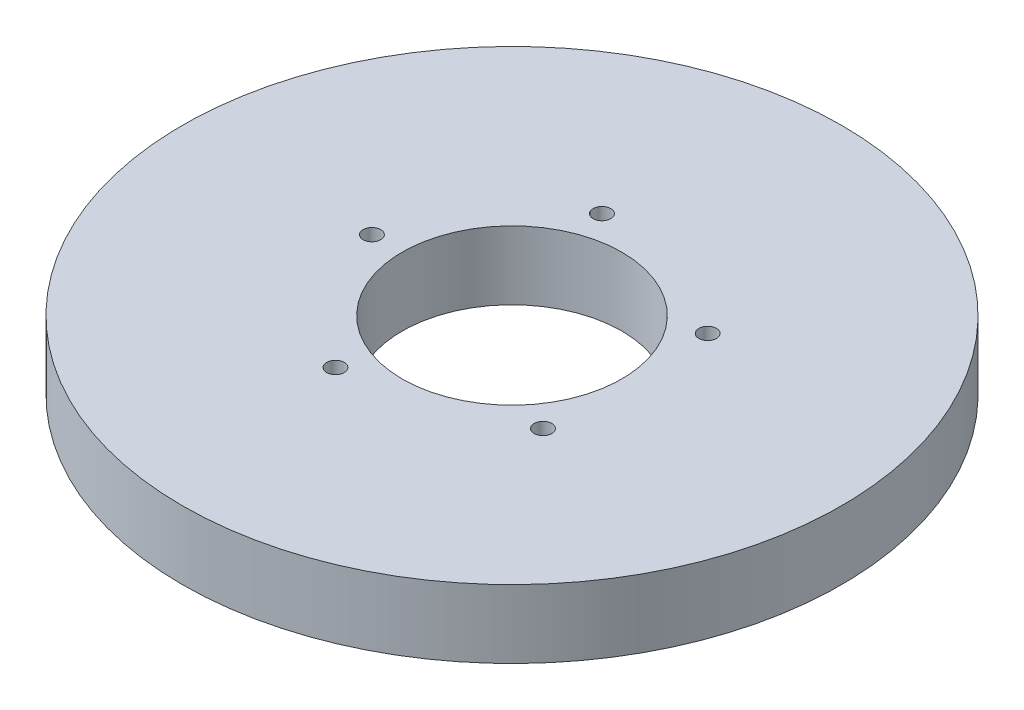
ISO-10303-21;
HEADER;
FILE_DESCRIPTION(('STEP AP214'),'2;1');
FILE_NAME('part.step','',(''),(''),'','','');
FILE_SCHEMA(('AUTOMOTIVE_DESIGN { 1 0 10303 214 1 1 1 1 }'));
ENDSEC;
DATA;
#1=APPLICATION_CONTEXT('core data for automotive mechanical design processes');
#2=APPLICATION_PROTOCOL_DEFINITION('international standard','automotive_design',2000,#1);
#3=PRODUCT_CONTEXT('',#1,'mechanical');
#4=PRODUCT('Part','Part','',(#3));
#5=PRODUCT_RELATED_PRODUCT_CATEGORY('part','',(#4));
#6=PRODUCT_DEFINITION_FORMATION('','',#4);
#7=PRODUCT_DEFINITION_CONTEXT('part definition',#1,'design');
#8=PRODUCT_DEFINITION('design','',#6,#7);
#9=PRODUCT_DEFINITION_SHAPE('','',#8);
#10=(LENGTH_UNIT() NAMED_UNIT(*) SI_UNIT(.MILLI.,.METRE.));
#11=(NAMED_UNIT(*) PLANE_ANGLE_UNIT() SI_UNIT($,.RADIAN.));
#12=(NAMED_UNIT(*) SI_UNIT($,.STERADIAN.) SOLID_ANGLE_UNIT());
#13=UNCERTAINTY_MEASURE_WITH_UNIT(LENGTH_MEASURE(1.E-05),#10,'distance_accuracy_value','');
#14=(GEOMETRIC_REPRESENTATION_CONTEXT(3) GLOBAL_UNCERTAINTY_ASSIGNED_CONTEXT((#13)) GLOBAL_UNIT_ASSIGNED_CONTEXT((#10,
#11,#12)) REPRESENTATION_CONTEXT('',''));
#15=CARTESIAN_POINT('',(0.,0.,0.));
#16=DIRECTION('',(0.,0.,1.));
#17=DIRECTION('',(1.,0.,0.));
#18=AXIS2_PLACEMENT_3D('',#15,#16,#17);
#19=CARTESIAN_POINT('',(0.,14.,0.));
#20=DIRECTION('',(0.,-1.,0.));
#21=DIRECTION('',(0.,0.,-1.));
#22=AXIS2_PLACEMENT_3D('',#19,#20,#21);
#23=CYLINDRICAL_SURFACE('',#22,67.5);
#24=CARTESIAN_POINT('',(0.,14.,0.));
#25=DIRECTION('',(0.,1.,0.));
#26=DIRECTION('',(0.,0.,1.));
#27=AXIS2_PLACEMENT_3D('',#24,#25,#26);
#28=CIRCLE('',#27,67.5);
#29=CARTESIAN_POINT('',(0.,14.,67.5));
#30=VERTEX_POINT('',#29);
#31=EDGE_CURVE('E10',#30,#30,#28,.T.);
#32=ORIENTED_EDGE('',*,*,#31,.F.);
#33=EDGE_LOOP('',(#32));
#34=FACE_BOUND('',#33,.T.);
#35=CARTESIAN_POINT('',(0.,0.,0.));
#36=DIRECTION('',(0.,1.,0.));
#37=DIRECTION('',(0.,0.,1.));
#38=AXIS2_PLACEMENT_3D('',#35,#36,#37);
#39=CIRCLE('',#38,67.5);
#40=CARTESIAN_POINT('',(0.,0.,67.5));
#41=VERTEX_POINT('',#40);
#42=EDGE_CURVE('E37',#41,#41,#39,.T.);
#43=ORIENTED_EDGE('',*,*,#42,.T.);
#44=EDGE_LOOP('',(#43));
#45=FACE_BOUND('',#44,.T.);
#46=ADVANCED_FACE('F40',(#34,#45),#23,.T.);
#47=CARTESIAN_POINT('',(0.,14.,0.));
#48=DIRECTION('',(0.,1.,0.));
#49=DIRECTION('',(0.,0.,1.));
#50=AXIS2_PLACEMENT_3D('',#47,#48,#49);
#51=PLANE('',#50);
#52=CARTESIAN_POINT('',(-8.86650054279167,14.,27.2882827529056));
#53=DIRECTION('',(0.,1.,0.));
#54=DIRECTION('',(0.951056516295155,0.,0.309016994374945));
#55=AXIS2_PLACEMENT_3D('',#52,#53,#54);
#56=CIRCLE('',#55,1.80070354562786);
#57=CARTESIAN_POINT('',(-8.86650054279167,14.,29.0889862985335));
#58=VERTEX_POINT('',#57);
#59=EDGE_CURVE('E78',#58,#58,#56,.T.);
#60=ORIENTED_EDGE('',*,*,#59,.F.);
#61=EDGE_LOOP('',(#60));
#62=FACE_BOUND('',#61,.T.);
#63=CARTESIAN_POINT('',(23.2127997822983,14.,16.8650862359131));
#64=DIRECTION('',(0.,1.,0.));
#65=DIRECTION('',(0.587785252292469,0.,-0.809016994374951));
#66=AXIS2_PLACEMENT_3D('',#63,#64,#65);
#67=CIRCLE('',#66,1.80070354562786);
#68=CARTESIAN_POINT('',(23.2127997822983,14.,18.6657897815409));
#69=VERTEX_POINT('',#68);
#70=EDGE_CURVE('E71',#69,#69,#67,.T.);
#71=ORIENTED_EDGE('',*,*,#70,.F.);
#72=EDGE_LOOP('',(#71));
#73=FACE_BOUND('',#72,.T.);
#74=CARTESIAN_POINT('',(23.212799782298,14.,-16.8650862359134));
#75=DIRECTION('',(0.,1.,0.));
#76=DIRECTION('',(-0.58778525229248,0.,-0.809016994374942));
#77=AXIS2_PLACEMENT_3D('',#74,#75,#76);
#78=CIRCLE('',#77,1.80070354562786);
#79=CARTESIAN_POINT('',(23.212799782298,14.,-15.0643826902856));
#80=VERTEX_POINT('',#79);
#81=EDGE_CURVE('E70',#80,#80,#78,.T.);
#82=ORIENTED_EDGE('',*,*,#81,.F.);
#83=EDGE_LOOP('',(#82));
#84=FACE_BOUND('',#83,.T.);
#85=CARTESIAN_POINT('',(-8.86650054279206,14.,-27.2882827529055));
#86=DIRECTION('',(0.,1.,0.));
#87=DIRECTION('',(-0.95105651629515,0.,0.309016994374958));
#88=AXIS2_PLACEMENT_3D('',#85,#86,#87);
#89=CIRCLE('',#88,1.80070354562786);
#90=CARTESIAN_POINT('',(-8.86650054279206,14.,-25.4875792072776));
#91=VERTEX_POINT('',#90);
#92=EDGE_CURVE('E61',#91,#91,#89,.T.);
#93=ORIENTED_EDGE('',*,*,#92,.F.);
#94=EDGE_LOOP('',(#93));
#95=FACE_BOUND('',#94,.T.);
#96=CARTESIAN_POINT('',(-28.6925984790129,14.,0.));
#97=DIRECTION('',(0.,1.,0.));
#98=DIRECTION('',(0.,0.,1.));
#99=AXIS2_PLACEMENT_3D('',#96,#97,#98);
#100=CIRCLE('',#99,1.80070354562786);
#101=CARTESIAN_POINT('',(-28.6925984790129,14.,1.80070354562786));
#102=VERTEX_POINT('',#101);
#103=EDGE_CURVE('E54',#102,#102,#100,.T.);
#104=ORIENTED_EDGE('',*,*,#103,.F.);
#105=EDGE_LOOP('',(#104));
#106=FACE_BOUND('',#105,.T.);
#107=CARTESIAN_POINT('',(0.,14.,0.));
#108=DIRECTION('',(0.,1.,0.));
#109=DIRECTION('',(0.,0.,1.));
#110=AXIS2_PLACEMENT_3D('',#107,#108,#109);
#111=CIRCLE('',#110,22.5);
#112=CARTESIAN_POINT('',(0.,14.,22.5));
#113=VERTEX_POINT('',#112);
#114=EDGE_CURVE('E50',#113,#113,#111,.T.);
#115=ORIENTED_EDGE('',*,*,#114,.F.);
#116=EDGE_LOOP('',(#115));
#117=FACE_BOUND('',#116,.T.);
#118=ORIENTED_EDGE('',*,*,#31,.T.);
#119=EDGE_LOOP('',(#118));
#120=FACE_BOUND('',#119,.T.);
#121=ADVANCED_FACE('F94',(#62,#73,#84,#95,#106,#117,#120),#51,.T.);
#122=CARTESIAN_POINT('',(0.,0.,0.));
#123=DIRECTION('',(0.,1.,0.));
#124=DIRECTION('',(0.,0.,1.));
#125=AXIS2_PLACEMENT_3D('',#122,#123,#124);
#126=PLANE('',#125);
#127=CARTESIAN_POINT('',(0.,0.,0.));
#128=DIRECTION('',(0.,1.,0.));
#129=DIRECTION('',(0.,0.,1.));
#130=AXIS2_PLACEMENT_3D('',#127,#128,#129);
#131=CIRCLE('',#130,22.5);
#132=CARTESIAN_POINT('',(0.,0.,22.5));
#133=VERTEX_POINT('',#132);
#134=EDGE_CURVE('E47',#133,#133,#131,.T.);
#135=ORIENTED_EDGE('',*,*,#134,.T.);
#136=EDGE_LOOP('',(#135));
#137=FACE_BOUND('',#136,.T.);
#138=ORIENTED_EDGE('',*,*,#42,.F.);
#139=EDGE_LOOP('',(#138));
#140=FACE_BOUND('',#139,.T.);
#141=ADVANCED_FACE('F100',(#137,#140),#126,.F.);
#142=CARTESIAN_POINT('',(0.,14.,0.));
#143=DIRECTION('',(0.,-1.,0.));
#144=DIRECTION('',(0.,0.,-1.));
#145=AXIS2_PLACEMENT_3D('',#142,#143,#144);
#146=CYLINDRICAL_SURFACE('',#145,22.5);
#147=ORIENTED_EDGE('',*,*,#114,.T.);
#148=EDGE_LOOP('',(#147));
#149=FACE_BOUND('',#148,.T.);
#150=ORIENTED_EDGE('',*,*,#134,.F.);
#151=EDGE_LOOP('',(#150));
#152=FACE_BOUND('',#151,.T.);
#153=ADVANCED_FACE('F108',(#149,#152),#146,.F.);
#154=CARTESIAN_POINT('',(-28.6925984790129,1.40341626221892,0.));
#155=DIRECTION('',(0.,1.,0.));
#156=DIRECTION('',(0.,0.,1.));
#157=AXIS2_PLACEMENT_3D('',#154,#155,#156);
#158=CYLINDRICAL_SURFACE('',#157,1.80070354562786);
#159=CARTESIAN_POINT('',(-28.6925984790129,1.40341626221892,0.));
#160=DIRECTION('',(0.,1.,0.));
#161=DIRECTION('',(0.,0.,1.));
#162=AXIS2_PLACEMENT_3D('',#159,#160,#161);
#163=CIRCLE('',#162,1.80070354562786);
#164=CARTESIAN_POINT('',(-28.6925984790129,1.40341626221892,1.80070354562786));
#165=VERTEX_POINT('',#164);
#166=EDGE_CURVE('E55',#165,#165,#163,.T.);
#167=CARTESIAN_POINT('',(-28.6925984790129,1.40341626221892,1.80070354562786));
#168=CARTESIAN_POINT('',(-28.6925984790129,1.53463067615414,1.80070354562786));
#169=CARTESIAN_POINT('',(-28.6925984790129,1.66584509008936,1.80070354562786));
#170=CARTESIAN_POINT('',(-28.6925984790129,1.92827391795979,1.80070354562786));
#171=CARTESIAN_POINT('',(-28.6925984790129,2.05948833189501,1.80070354562786));
#172=CARTESIAN_POINT('',(-28.6925984790129,2.32191715976545,1.80070354562786));
#173=CARTESIAN_POINT('',(-28.6925984790129,2.45313157370067,1.80070354562786));
#174=CARTESIAN_POINT('',(-28.6925984790129,2.71556040157111,1.80070354562786));
#175=CARTESIAN_POINT('',(-28.6925984790129,2.84677481550633,1.80070354562786));
#176=CARTESIAN_POINT('',(-28.6925984790129,3.10920364337677,1.80070354562786));
#177=CARTESIAN_POINT('',(-28.6925984790129,3.24041805731199,1.80070354562786));
#178=CARTESIAN_POINT('',(-28.6925984790129,3.50284688518243,1.80070354562786));
#179=CARTESIAN_POINT('',(-28.6925984790129,3.63406129911765,1.80070354562786));
#180=CARTESIAN_POINT('',(-28.6925984790129,3.89649012698809,1.80070354562786));
#181=CARTESIAN_POINT('',(-28.6925984790129,4.02770454092331,1.80070354562786));
#182=CARTESIAN_POINT('',(-28.6925984790129,4.29013336879375,1.80070354562786));
#183=CARTESIAN_POINT('',(-28.6925984790129,4.42134778272897,1.80070354562786));
#184=CARTESIAN_POINT('',(-28.6925984790129,4.68377661059941,1.80070354562786));
#185=CARTESIAN_POINT('',(-28.6925984790129,4.81499102453463,1.80070354562786));
#186=CARTESIAN_POINT('',(-28.6925984790129,5.07741985240507,1.80070354562786));
#187=CARTESIAN_POINT('',(-28.6925984790129,5.20863426634028,1.80070354562786));
#188=CARTESIAN_POINT('',(-28.6925984790129,5.47106309421072,1.80070354562786));
#189=CARTESIAN_POINT('',(-28.6925984790129,5.60227750814594,1.80070354562786));
#190=CARTESIAN_POINT('',(-28.6925984790129,5.86470633601638,1.80070354562786));
#191=CARTESIAN_POINT('',(-28.6925984790129,5.9959207499516,1.80070354562786));
#192=CARTESIAN_POINT('',(-28.6925984790129,6.25834957782204,1.80070354562786));
#193=CARTESIAN_POINT('',(-28.6925984790129,6.38956399175726,1.80070354562786));
#194=CARTESIAN_POINT('',(-28.6925984790129,6.6519928196277,1.80070354562786));
#195=CARTESIAN_POINT('',(-28.6925984790129,6.78320723356292,1.80070354562786));
#196=CARTESIAN_POINT('',(-28.6925984790129,7.04563606143336,1.80070354562786));
#197=CARTESIAN_POINT('',(-28.6925984790129,7.17685047536858,1.80070354562786));
#198=CARTESIAN_POINT('',(-28.6925984790129,7.43927930323902,1.80070354562786));
#199=CARTESIAN_POINT('',(-28.6925984790129,7.57049371717424,1.80070354562786));
#200=CARTESIAN_POINT('',(-28.6925984790129,7.83292254504468,1.80070354562786));
#201=CARTESIAN_POINT('',(-28.6925984790129,7.9641369589799,1.80070354562786));
#202=CARTESIAN_POINT('',(-28.6925984790129,8.22656578685034,1.80070354562786));
#203=CARTESIAN_POINT('',(-28.6925984790129,8.35778020078556,1.80070354562786));
#204=CARTESIAN_POINT('',(-28.6925984790129,8.62020902865599,1.80070354562786));
#205=CARTESIAN_POINT('',(-28.6925984790129,8.75142344259121,1.80070354562786));
#206=CARTESIAN_POINT('',(-28.6925984790129,9.01385227046165,1.80070354562786));
#207=CARTESIAN_POINT('',(-28.6925984790129,9.14506668439687,1.80070354562786));
#208=CARTESIAN_POINT('',(-28.6925984790129,9.40749551226731,1.80070354562786));
#209=CARTESIAN_POINT('',(-28.6925984790129,9.53870992620253,1.80070354562786));
#210=CARTESIAN_POINT('',(-28.6925984790129,9.80113875407297,1.80070354562786));
#211=CARTESIAN_POINT('',(-28.6925984790129,9.93235316800819,1.80070354562786));
#212=CARTESIAN_POINT('',(-28.6925984790129,10.1947819958786,1.80070354562786));
#213=CARTESIAN_POINT('',(-28.6925984790129,10.3259964098138,1.80070354562786));
#214=CARTESIAN_POINT('',(-28.6925984790129,10.5884252376843,1.80070354562786));
#215=CARTESIAN_POINT('',(-28.6925984790129,10.7196396516195,1.80070354562786));
#216=CARTESIAN_POINT('',(-28.6925984790129,10.9820684794899,1.80070354562786));
#217=CARTESIAN_POINT('',(-28.6925984790129,11.1132828934252,1.80070354562786));
#218=CARTESIAN_POINT('',(-28.6925984790129,11.3757117212956,1.80070354562786));
#219=CARTESIAN_POINT('',(-28.6925984790129,11.5069261352308,1.80070354562786));
#220=CARTESIAN_POINT('',(-28.6925984790129,11.7693549631013,1.80070354562786));
#221=CARTESIAN_POINT('',(-28.6925984790129,11.9005693770365,1.80070354562786));
#222=CARTESIAN_POINT('',(-28.6925984790129,12.1629982049069,1.80070354562786));
#223=CARTESIAN_POINT('',(-28.6925984790129,12.2942126188421,1.80070354562786));
#224=CARTESIAN_POINT('',(-28.6925984790129,12.5566414467126,1.80070354562786));
#225=CARTESIAN_POINT('',(-28.6925984790129,12.6878558606478,1.80070354562786));
#226=CARTESIAN_POINT('',(-28.6925984790129,12.9502846885182,1.80070354562786));
#227=CARTESIAN_POINT('',(-28.6925984790129,13.0814991024535,1.80070354562786));
#228=CARTESIAN_POINT('',(-28.6925984790129,13.3439279303239,1.80070354562786));
#229=CARTESIAN_POINT('',(-28.6925984790129,13.4751423442591,1.80070354562786));
#230=CARTESIAN_POINT('',(-28.6925984790129,13.7375711721296,1.80070354562786));
#231=CARTESIAN_POINT('',(-28.6925984790129,13.8687855860648,1.80070354562786));
#232=CARTESIAN_POINT('',(-28.6925984790129,14.,1.80070354562786));
#233=B_SPLINE_CURVE_WITH_KNOTS('',3,(#167,#168,#169,#170,#171,#172,#173,#174,#175,#176,#177,
#178,#179,#180,#181,#182,#183,#184,#185,#186,#187,#188,#189,#190,#191,#192,#193,#194,#195,#196,
#197,#198,#199,#200,#201,#202,#203,#204,#205,#206,#207,#208,#209,#210,#211,#212,#213,#214,#215,
#216,#217,#218,#219,#220,#221,#222,#223,#224,#225,#226,#227,#228,#229,#230,#231,#232),
.UNSPECIFIED.,.F.,.F.,(4,2,2,2,2,2,2,2,2,2,2,2,2,2,2,2,2,2,2,2,2,2,2,2,2,2,2,2,2,2,2,2,4),(0.,
0.393643241805659,0.787286483611318,1.18092972541698,1.57457296722264,1.96821620902829,
2.36185945083395,2.75550269263961,3.14914593444527,3.54278917625093,3.93643241805659,
4.33007565986225,4.72371890166791,5.11736214347356,5.51100538527922,5.90464862708488,
6.29829186889054,6.6919351106962,7.08557835250186,7.47922159430752,7.87286483611318,
8.26650807791884,8.66015131972449,9.05379456153015,9.44743780333581,9.84108104514147,
10.2347242869471,10.6283675287528,11.0220107705584,11.4156540123641,11.8092972541698,
12.2029404959754,12.5965837377811),.UNSPECIFIED.);
#234=EDGE_CURVE('BSEAM115',#165,#102,#233,.T.);
#235=ORIENTED_EDGE('',*,*,#166,.F.);
#236=ORIENTED_EDGE('',*,*,#103,.T.);
#237=ORIENTED_EDGE('',*,*,#234,.T.);
#238=ORIENTED_EDGE('',*,*,#234,.F.);
#239=EDGE_LOOP('',(#235,#237,#236,#238));
#240=FACE_BOUND('',#239,.T.);
#241=ADVANCED_FACE('F115',(#240),#158,.F.);
#242=CARTESIAN_POINT('',(-28.6925984790129,1.40341626221892,0.));
#243=DIRECTION('',(0.,1.,0.));
#244=DIRECTION('',(0.,0.,1.));
#245=AXIS2_PLACEMENT_3D('',#242,#243,#244);
#246=PLANE('',#245);
#247=ORIENTED_EDGE('',*,*,#166,.T.);
#248=EDGE_LOOP('',(#247));
#249=FACE_BOUND('',#248,.T.);
#250=ADVANCED_FACE('F142',(#249),#246,.T.);
#251=CARTESIAN_POINT('',(-8.86650054279206,1.40341626221892,-27.2882827529055));
#252=DIRECTION('',(0.,1.,0.));
#253=DIRECTION('',(0.,0.,1.));
#254=AXIS2_PLACEMENT_3D('',#251,#252,#253);
#255=CYLINDRICAL_SURFACE('',#254,1.80070354562786);
#256=CARTESIAN_POINT('',(-8.86650054279206,1.40341626221892,-27.2882827529055));
#257=DIRECTION('',(0.,1.,0.));
#258=DIRECTION('',(-0.95105651629515,0.,0.309016994374958));
#259=AXIS2_PLACEMENT_3D('',#256,#257,#258);
#260=CIRCLE('',#259,1.80070354562786);
#261=CARTESIAN_POINT('',(-8.86650054279206,1.40341626221892,-25.4875792072776));
#262=VERTEX_POINT('',#261);
#263=EDGE_CURVE('E63',#262,#262,#260,.T.);
#264=CARTESIAN_POINT('',(-8.86650054279206,1.40341626221892,-25.4875792072776));
#265=CARTESIAN_POINT('',(-8.86650054279206,1.53463067615414,-25.4875792072776));
#266=CARTESIAN_POINT('',(-8.86650054279206,1.66584509008936,-25.4875792072776));
#267=CARTESIAN_POINT('',(-8.86650054279206,1.92827391795979,-25.4875792072776));
#268=CARTESIAN_POINT('',(-8.86650054279206,2.05948833189501,-25.4875792072776));
#269=CARTESIAN_POINT('',(-8.86650054279206,2.32191715976545,-25.4875792072776));
#270=CARTESIAN_POINT('',(-8.86650054279206,2.45313157370067,-25.4875792072776));
#271=CARTESIAN_POINT('',(-8.86650054279206,2.71556040157111,-25.4875792072776));
#272=CARTESIAN_POINT('',(-8.86650054279206,2.84677481550633,-25.4875792072776));
#273=CARTESIAN_POINT('',(-8.86650054279206,3.10920364337677,-25.4875792072776));
#274=CARTESIAN_POINT('',(-8.86650054279206,3.24041805731199,-25.4875792072776));
#275=CARTESIAN_POINT('',(-8.86650054279206,3.50284688518243,-25.4875792072776));
#276=CARTESIAN_POINT('',(-8.86650054279206,3.63406129911765,-25.4875792072776));
#277=CARTESIAN_POINT('',(-8.86650054279206,3.89649012698809,-25.4875792072776));
#278=CARTESIAN_POINT('',(-8.86650054279206,4.02770454092331,-25.4875792072776));
#279=CARTESIAN_POINT('',(-8.86650054279206,4.29013336879375,-25.4875792072776));
#280=CARTESIAN_POINT('',(-8.86650054279206,4.42134778272897,-25.4875792072776));
#281=CARTESIAN_POINT('',(-8.86650054279206,4.68377661059941,-25.4875792072776));
#282=CARTESIAN_POINT('',(-8.86650054279206,4.81499102453463,-25.4875792072776));
#283=CARTESIAN_POINT('',(-8.86650054279206,5.07741985240507,-25.4875792072776));
#284=CARTESIAN_POINT('',(-8.86650054279206,5.20863426634028,-25.4875792072776));
#285=CARTESIAN_POINT('',(-8.86650054279206,5.47106309421072,-25.4875792072776));
#286=CARTESIAN_POINT('',(-8.86650054279206,5.60227750814594,-25.4875792072776));
#287=CARTESIAN_POINT('',(-8.86650054279206,5.86470633601638,-25.4875792072776));
#288=CARTESIAN_POINT('',(-8.86650054279206,5.9959207499516,-25.4875792072776));
#289=CARTESIAN_POINT('',(-8.86650054279206,6.25834957782204,-25.4875792072776));
#290=CARTESIAN_POINT('',(-8.86650054279206,6.38956399175726,-25.4875792072776));
#291=CARTESIAN_POINT('',(-8.86650054279206,6.6519928196277,-25.4875792072776));
#292=CARTESIAN_POINT('',(-8.86650054279206,6.78320723356292,-25.4875792072776));
#293=CARTESIAN_POINT('',(-8.86650054279206,7.04563606143336,-25.4875792072776));
#294=CARTESIAN_POINT('',(-8.86650054279206,7.17685047536858,-25.4875792072776));
#295=CARTESIAN_POINT('',(-8.86650054279206,7.43927930323902,-25.4875792072776));
#296=CARTESIAN_POINT('',(-8.86650054279206,7.57049371717424,-25.4875792072776));
#297=CARTESIAN_POINT('',(-8.86650054279206,7.83292254504468,-25.4875792072776));
#298=CARTESIAN_POINT('',(-8.86650054279206,7.9641369589799,-25.4875792072776));
#299=CARTESIAN_POINT('',(-8.86650054279206,8.22656578685034,-25.4875792072776));
#300=CARTESIAN_POINT('',(-8.86650054279206,8.35778020078556,-25.4875792072776));
#301=CARTESIAN_POINT('',(-8.86650054279206,8.62020902865599,-25.4875792072776));
#302=CARTESIAN_POINT('',(-8.86650054279206,8.75142344259121,-25.4875792072776));
#303=CARTESIAN_POINT('',(-8.86650054279206,9.01385227046165,-25.4875792072776));
#304=CARTESIAN_POINT('',(-8.86650054279206,9.14506668439687,-25.4875792072776));
#305=CARTESIAN_POINT('',(-8.86650054279206,9.40749551226731,-25.4875792072776));
#306=CARTESIAN_POINT('',(-8.86650054279206,9.53870992620253,-25.4875792072776));
#307=CARTESIAN_POINT('',(-8.86650054279206,9.80113875407297,-25.4875792072776));
#308=CARTESIAN_POINT('',(-8.86650054279206,9.93235316800819,-25.4875792072776));
#309=CARTESIAN_POINT('',(-8.86650054279206,10.1947819958786,-25.4875792072776));
#310=CARTESIAN_POINT('',(-8.86650054279206,10.3259964098138,-25.4875792072776));
#311=CARTESIAN_POINT('',(-8.86650054279206,10.5884252376843,-25.4875792072776));
#312=CARTESIAN_POINT('',(-8.86650054279206,10.7196396516195,-25.4875792072776));
#313=CARTESIAN_POINT('',(-8.86650054279206,10.9820684794899,-25.4875792072776));
#314=CARTESIAN_POINT('',(-8.86650054279206,11.1132828934252,-25.4875792072776));
#315=CARTESIAN_POINT('',(-8.86650054279206,11.3757117212956,-25.4875792072776));
#316=CARTESIAN_POINT('',(-8.86650054279206,11.5069261352308,-25.4875792072776));
#317=CARTESIAN_POINT('',(-8.86650054279206,11.7693549631013,-25.4875792072776));
#318=CARTESIAN_POINT('',(-8.86650054279206,11.9005693770365,-25.4875792072776));
#319=CARTESIAN_POINT('',(-8.86650054279206,12.1629982049069,-25.4875792072776));
#320=CARTESIAN_POINT('',(-8.86650054279206,12.2942126188421,-25.4875792072776));
#321=CARTESIAN_POINT('',(-8.86650054279206,12.5566414467126,-25.4875792072776));
#322=CARTESIAN_POINT('',(-8.86650054279206,12.6878558606478,-25.4875792072776));
#323=CARTESIAN_POINT('',(-8.86650054279206,12.9502846885182,-25.4875792072776));
#324=CARTESIAN_POINT('',(-8.86650054279206,13.0814991024535,-25.4875792072776));
#325=CARTESIAN_POINT('',(-8.86650054279206,13.3439279303239,-25.4875792072776));
#326=CARTESIAN_POINT('',(-8.86650054279206,13.4751423442591,-25.4875792072776));
#327=CARTESIAN_POINT('',(-8.86650054279206,13.7375711721296,-25.4875792072776));
#328=CARTESIAN_POINT('',(-8.86650054279206,13.8687855860648,-25.4875792072776));
#329=CARTESIAN_POINT('',(-8.86650054279206,14.,-25.4875792072776));
#330=B_SPLINE_CURVE_WITH_KNOTS('',3,(#264,#265,#266,#267,#268,#269,#270,#271,#272,#273,#274,
#275,#276,#277,#278,#279,#280,#281,#282,#283,#284,#285,#286,#287,#288,#289,#290,#291,#292,#293,
#294,#295,#296,#297,#298,#299,#300,#301,#302,#303,#304,#305,#306,#307,#308,#309,#310,#311,#312,
#313,#314,#315,#316,#317,#318,#319,#320,#321,#322,#323,#324,#325,#326,#327,#328,#329),
.UNSPECIFIED.,.F.,.F.,(4,2,2,2,2,2,2,2,2,2,2,2,2,2,2,2,2,2,2,2,2,2,2,2,2,2,2,2,2,2,2,2,4),(0.,
0.393643241805659,0.787286483611318,1.18092972541698,1.57457296722264,1.96821620902829,
2.36185945083395,2.75550269263961,3.14914593444527,3.54278917625093,3.93643241805659,
4.33007565986225,4.72371890166791,5.11736214347356,5.51100538527922,5.90464862708488,
6.29829186889054,6.6919351106962,7.08557835250186,7.47922159430752,7.87286483611318,
8.26650807791884,8.66015131972449,9.05379456153015,9.44743780333581,9.84108104514147,
10.2347242869471,10.6283675287528,11.0220107705584,11.4156540123641,11.8092972541698,
12.2029404959754,12.5965837377811),.UNSPECIFIED.);
#331=EDGE_CURVE('BSEAM147',#262,#91,#330,.T.);
#332=ORIENTED_EDGE('',*,*,#263,.F.);
#333=ORIENTED_EDGE('',*,*,#92,.T.);
#334=ORIENTED_EDGE('',*,*,#331,.T.);
#335=ORIENTED_EDGE('',*,*,#331,.F.);
#336=EDGE_LOOP('',(#332,#334,#333,#335));
#337=FACE_BOUND('',#336,.T.);
#338=ADVANCED_FACE('F147',(#337),#255,.F.);
#339=CARTESIAN_POINT('',(-8.86650054279206,1.40341626221892,-27.2882827529055));
#340=DIRECTION('',(0.,1.,0.));
#341=DIRECTION('',(-0.95105651629515,0.,0.309016994374958));
#342=AXIS2_PLACEMENT_3D('',#339,#340,#341);
#343=PLANE('',#342);
#344=ORIENTED_EDGE('',*,*,#263,.T.);
#345=EDGE_LOOP('',(#344));
#346=FACE_BOUND('',#345,.T.);
#347=ADVANCED_FACE('F163',(#346),#343,.T.);
#348=CARTESIAN_POINT('',(23.212799782298,1.40341626221892,-16.8650862359134));
#349=DIRECTION('',(0.,1.,0.));
#350=DIRECTION('',(0.,0.,1.));
#351=AXIS2_PLACEMENT_3D('',#348,#349,#350);
#352=CYLINDRICAL_SURFACE('',#351,1.80070354562786);
#353=CARTESIAN_POINT('',(23.212799782298,1.40341626221892,-16.8650862359134));
#354=DIRECTION('',(0.,1.,0.));
#355=DIRECTION('',(-0.58778525229248,0.,-0.809016994374942));
#356=AXIS2_PLACEMENT_3D('',#353,#354,#355);
#357=CIRCLE('',#356,1.80070354562786);
#358=CARTESIAN_POINT('',(23.212799782298,1.40341626221892,-15.0643826902856));
#359=VERTEX_POINT('',#358);
#360=EDGE_CURVE('E69',#359,#359,#357,.T.);
#361=CARTESIAN_POINT('',(23.212799782298,1.40341626221892,-15.0643826902856));
#362=CARTESIAN_POINT('',(23.212799782298,1.53463067615414,-15.0643826902856));
#363=CARTESIAN_POINT('',(23.212799782298,1.66584509008936,-15.0643826902856));
#364=CARTESIAN_POINT('',(23.212799782298,1.92827391795979,-15.0643826902856));
#365=CARTESIAN_POINT('',(23.212799782298,2.05948833189501,-15.0643826902856));
#366=CARTESIAN_POINT('',(23.212799782298,2.32191715976545,-15.0643826902856));
#367=CARTESIAN_POINT('',(23.212799782298,2.45313157370067,-15.0643826902856));
#368=CARTESIAN_POINT('',(23.212799782298,2.71556040157111,-15.0643826902856));
#369=CARTESIAN_POINT('',(23.212799782298,2.84677481550633,-15.0643826902856));
#370=CARTESIAN_POINT('',(23.212799782298,3.10920364337677,-15.0643826902856));
#371=CARTESIAN_POINT('',(23.212799782298,3.24041805731199,-15.0643826902856));
#372=CARTESIAN_POINT('',(23.212799782298,3.50284688518243,-15.0643826902856));
#373=CARTESIAN_POINT('',(23.212799782298,3.63406129911765,-15.0643826902856));
#374=CARTESIAN_POINT('',(23.212799782298,3.89649012698809,-15.0643826902856));
#375=CARTESIAN_POINT('',(23.212799782298,4.02770454092331,-15.0643826902856));
#376=CARTESIAN_POINT('',(23.212799782298,4.29013336879375,-15.0643826902856));
#377=CARTESIAN_POINT('',(23.212799782298,4.42134778272897,-15.0643826902856));
#378=CARTESIAN_POINT('',(23.212799782298,4.68377661059941,-15.0643826902856));
#379=CARTESIAN_POINT('',(23.212799782298,4.81499102453463,-15.0643826902856));
#380=CARTESIAN_POINT('',(23.212799782298,5.07741985240507,-15.0643826902856));
#381=CARTESIAN_POINT('',(23.212799782298,5.20863426634028,-15.0643826902856));
#382=CARTESIAN_POINT('',(23.212799782298,5.47106309421072,-15.0643826902856));
#383=CARTESIAN_POINT('',(23.212799782298,5.60227750814594,-15.0643826902856));
#384=CARTESIAN_POINT('',(23.212799782298,5.86470633601638,-15.0643826902856));
#385=CARTESIAN_POINT('',(23.212799782298,5.9959207499516,-15.0643826902856));
#386=CARTESIAN_POINT('',(23.212799782298,6.25834957782204,-15.0643826902856));
#387=CARTESIAN_POINT('',(23.212799782298,6.38956399175726,-15.0643826902856));
#388=CARTESIAN_POINT('',(23.212799782298,6.6519928196277,-15.0643826902856));
#389=CARTESIAN_POINT('',(23.212799782298,6.78320723356292,-15.0643826902856));
#390=CARTESIAN_POINT('',(23.212799782298,7.04563606143336,-15.0643826902856));
#391=CARTESIAN_POINT('',(23.212799782298,7.17685047536858,-15.0643826902856));
#392=CARTESIAN_POINT('',(23.212799782298,7.43927930323902,-15.0643826902856));
#393=CARTESIAN_POINT('',(23.212799782298,7.57049371717424,-15.0643826902856));
#394=CARTESIAN_POINT('',(23.212799782298,7.83292254504468,-15.0643826902856));
#395=CARTESIAN_POINT('',(23.212799782298,7.9641369589799,-15.0643826902856));
#396=CARTESIAN_POINT('',(23.212799782298,8.22656578685034,-15.0643826902856));
#397=CARTESIAN_POINT('',(23.212799782298,8.35778020078556,-15.0643826902856));
#398=CARTESIAN_POINT('',(23.212799782298,8.62020902865599,-15.0643826902856));
#399=CARTESIAN_POINT('',(23.212799782298,8.75142344259121,-15.0643826902856));
#400=CARTESIAN_POINT('',(23.212799782298,9.01385227046165,-15.0643826902856));
#401=CARTESIAN_POINT('',(23.212799782298,9.14506668439687,-15.0643826902856));
#402=CARTESIAN_POINT('',(23.212799782298,9.40749551226731,-15.0643826902856));
#403=CARTESIAN_POINT('',(23.212799782298,9.53870992620253,-15.0643826902856));
#404=CARTESIAN_POINT('',(23.212799782298,9.80113875407297,-15.0643826902856));
#405=CARTESIAN_POINT('',(23.212799782298,9.93235316800819,-15.0643826902856));
#406=CARTESIAN_POINT('',(23.212799782298,10.1947819958786,-15.0643826902856));
#407=CARTESIAN_POINT('',(23.212799782298,10.3259964098138,-15.0643826902856));
#408=CARTESIAN_POINT('',(23.212799782298,10.5884252376843,-15.0643826902856));
#409=CARTESIAN_POINT('',(23.212799782298,10.7196396516195,-15.0643826902856));
#410=CARTESIAN_POINT('',(23.212799782298,10.9820684794899,-15.0643826902856));
#411=CARTESIAN_POINT('',(23.212799782298,11.1132828934252,-15.0643826902856));
#412=CARTESIAN_POINT('',(23.212799782298,11.3757117212956,-15.0643826902856));
#413=CARTESIAN_POINT('',(23.212799782298,11.5069261352308,-15.0643826902856));
#414=CARTESIAN_POINT('',(23.212799782298,11.7693549631013,-15.0643826902856));
#415=CARTESIAN_POINT('',(23.212799782298,11.9005693770365,-15.0643826902856));
#416=CARTESIAN_POINT('',(23.212799782298,12.1629982049069,-15.0643826902856));
#417=CARTESIAN_POINT('',(23.212799782298,12.2942126188421,-15.0643826902856));
#418=CARTESIAN_POINT('',(23.212799782298,12.5566414467126,-15.0643826902856));
#419=CARTESIAN_POINT('',(23.212799782298,12.6878558606478,-15.0643826902856));
#420=CARTESIAN_POINT('',(23.212799782298,12.9502846885182,-15.0643826902856));
#421=CARTESIAN_POINT('',(23.212799782298,13.0814991024535,-15.0643826902856));
#422=CARTESIAN_POINT('',(23.212799782298,13.3439279303239,-15.0643826902856));
#423=CARTESIAN_POINT('',(23.212799782298,13.4751423442591,-15.0643826902856));
#424=CARTESIAN_POINT('',(23.212799782298,13.7375711721296,-15.0643826902856));
#425=CARTESIAN_POINT('',(23.212799782298,13.8687855860648,-15.0643826902856));
#426=CARTESIAN_POINT('',(23.212799782298,14.,-15.0643826902856));
#427=B_SPLINE_CURVE_WITH_KNOTS('',3,(#361,#362,#363,#364,#365,#366,#367,#368,#369,#370,#371,
#372,#373,#374,#375,#376,#377,#378,#379,#380,#381,#382,#383,#384,#385,#386,#387,#388,#389,#390,
#391,#392,#393,#394,#395,#396,#397,#398,#399,#400,#401,#402,#403,#404,#405,#406,#407,#408,#409,
#410,#411,#412,#413,#414,#415,#416,#417,#418,#419,#420,#421,#422,#423,#424,#425,#426),
.UNSPECIFIED.,.F.,.F.,(4,2,2,2,2,2,2,2,2,2,2,2,2,2,2,2,2,2,2,2,2,2,2,2,2,2,2,2,2,2,2,2,4),(0.,
0.393643241805659,0.787286483611318,1.18092972541698,1.57457296722264,1.96821620902829,
2.36185945083395,2.75550269263961,3.14914593444527,3.54278917625093,3.93643241805659,
4.33007565986225,4.72371890166791,5.11736214347356,5.51100538527922,5.90464862708488,
6.29829186889054,6.6919351106962,7.08557835250186,7.47922159430752,7.87286483611318,
8.26650807791884,8.66015131972449,9.05379456153015,9.44743780333581,9.84108104514147,
10.2347242869471,10.6283675287528,11.0220107705584,11.4156540123641,11.8092972541698,
12.2029404959754,12.5965837377811),.UNSPECIFIED.);
#428=EDGE_CURVE('BSEAM172',#359,#80,#427,.T.);
#429=ORIENTED_EDGE('',*,*,#360,.F.);
#430=ORIENTED_EDGE('',*,*,#81,.T.);
#431=ORIENTED_EDGE('',*,*,#428,.T.);
#432=ORIENTED_EDGE('',*,*,#428,.F.);
#433=EDGE_LOOP('',(#429,#431,#430,#432));
#434=FACE_BOUND('',#433,.T.);
#435=ADVANCED_FACE('F172',(#434),#352,.F.);
#436=CARTESIAN_POINT('',(23.212799782298,1.40341626221892,-16.8650862359134));
#437=DIRECTION('',(0.,1.,0.));
#438=DIRECTION('',(-0.58778525229248,0.,-0.809016994374942));
#439=AXIS2_PLACEMENT_3D('',#436,#437,#438);
#440=PLANE('',#439);
#441=ORIENTED_EDGE('',*,*,#360,.T.);
#442=EDGE_LOOP('',(#441));
#443=FACE_BOUND('',#442,.T.);
#444=ADVANCED_FACE('F185',(#443),#440,.T.);
#445=CARTESIAN_POINT('',(23.2127997822983,1.40341626221892,16.8650862359131));
#446=DIRECTION('',(0.,1.,0.));
#447=DIRECTION('',(0.,0.,1.));
#448=AXIS2_PLACEMENT_3D('',#445,#446,#447);
#449=CYLINDRICAL_SURFACE('',#448,1.80070354562786);
#450=CARTESIAN_POINT('',(23.2127997822983,1.40341626221892,16.8650862359131));
#451=DIRECTION('',(0.,1.,0.));
#452=DIRECTION('',(0.587785252292469,0.,-0.809016994374951));
#453=AXIS2_PLACEMENT_3D('',#450,#451,#452);
#454=CIRCLE('',#453,1.80070354562786);
#455=CARTESIAN_POINT('',(23.2127997822983,1.40341626221892,18.6657897815409));
#456=VERTEX_POINT('',#455);
#457=EDGE_CURVE('E76',#456,#456,#454,.T.);
#458=CARTESIAN_POINT('',(23.2127997822983,1.40341626221892,18.6657897815409));
#459=CARTESIAN_POINT('',(23.2127997822983,1.53463067615414,18.6657897815409));
#460=CARTESIAN_POINT('',(23.2127997822983,1.66584509008936,18.6657897815409));
#461=CARTESIAN_POINT('',(23.2127997822983,1.92827391795979,18.6657897815409));
#462=CARTESIAN_POINT('',(23.2127997822983,2.05948833189501,18.6657897815409));
#463=CARTESIAN_POINT('',(23.2127997822983,2.32191715976545,18.6657897815409));
#464=CARTESIAN_POINT('',(23.2127997822983,2.45313157370067,18.6657897815409));
#465=CARTESIAN_POINT('',(23.2127997822983,2.71556040157111,18.6657897815409));
#466=CARTESIAN_POINT('',(23.2127997822983,2.84677481550633,18.6657897815409));
#467=CARTESIAN_POINT('',(23.2127997822983,3.10920364337677,18.6657897815409));
#468=CARTESIAN_POINT('',(23.2127997822983,3.24041805731199,18.6657897815409));
#469=CARTESIAN_POINT('',(23.2127997822983,3.50284688518243,18.6657897815409));
#470=CARTESIAN_POINT('',(23.2127997822983,3.63406129911765,18.6657897815409));
#471=CARTESIAN_POINT('',(23.2127997822983,3.89649012698809,18.6657897815409));
#472=CARTESIAN_POINT('',(23.2127997822983,4.02770454092331,18.6657897815409));
#473=CARTESIAN_POINT('',(23.2127997822983,4.29013336879375,18.6657897815409));
#474=CARTESIAN_POINT('',(23.2127997822983,4.42134778272897,18.6657897815409));
#475=CARTESIAN_POINT('',(23.2127997822983,4.68377661059941,18.6657897815409));
#476=CARTESIAN_POINT('',(23.2127997822983,4.81499102453463,18.6657897815409));
#477=CARTESIAN_POINT('',(23.2127997822983,5.07741985240507,18.6657897815409));
#478=CARTESIAN_POINT('',(23.2127997822983,5.20863426634028,18.6657897815409));
#479=CARTESIAN_POINT('',(23.2127997822983,5.47106309421072,18.6657897815409));
#480=CARTESIAN_POINT('',(23.2127997822983,5.60227750814594,18.6657897815409));
#481=CARTESIAN_POINT('',(23.2127997822983,5.86470633601638,18.6657897815409));
#482=CARTESIAN_POINT('',(23.2127997822983,5.9959207499516,18.6657897815409));
#483=CARTESIAN_POINT('',(23.2127997822983,6.25834957782204,18.6657897815409));
#484=CARTESIAN_POINT('',(23.2127997822983,6.38956399175726,18.6657897815409));
#485=CARTESIAN_POINT('',(23.2127997822983,6.6519928196277,18.6657897815409));
#486=CARTESIAN_POINT('',(23.2127997822983,6.78320723356292,18.6657897815409));
#487=CARTESIAN_POINT('',(23.2127997822983,7.04563606143336,18.6657897815409));
#488=CARTESIAN_POINT('',(23.2127997822983,7.17685047536858,18.6657897815409));
#489=CARTESIAN_POINT('',(23.2127997822983,7.43927930323902,18.6657897815409));
#490=CARTESIAN_POINT('',(23.2127997822983,7.57049371717424,18.6657897815409));
#491=CARTESIAN_POINT('',(23.2127997822983,7.83292254504468,18.6657897815409));
#492=CARTESIAN_POINT('',(23.2127997822983,7.9641369589799,18.6657897815409));
#493=CARTESIAN_POINT('',(23.2127997822983,8.22656578685034,18.6657897815409));
#494=CARTESIAN_POINT('',(23.2127997822983,8.35778020078556,18.6657897815409));
#495=CARTESIAN_POINT('',(23.2127997822983,8.62020902865599,18.6657897815409));
#496=CARTESIAN_POINT('',(23.2127997822983,8.75142344259121,18.6657897815409));
#497=CARTESIAN_POINT('',(23.2127997822983,9.01385227046165,18.6657897815409));
#498=CARTESIAN_POINT('',(23.2127997822983,9.14506668439687,18.6657897815409));
#499=CARTESIAN_POINT('',(23.2127997822983,9.40749551226731,18.6657897815409));
#500=CARTESIAN_POINT('',(23.2127997822983,9.53870992620253,18.6657897815409));
#501=CARTESIAN_POINT('',(23.2127997822983,9.80113875407297,18.6657897815409));
#502=CARTESIAN_POINT('',(23.2127997822983,9.93235316800819,18.6657897815409));
#503=CARTESIAN_POINT('',(23.2127997822983,10.1947819958786,18.6657897815409));
#504=CARTESIAN_POINT('',(23.2127997822983,10.3259964098138,18.6657897815409));
#505=CARTESIAN_POINT('',(23.2127997822983,10.5884252376843,18.6657897815409));
#506=CARTESIAN_POINT('',(23.2127997822983,10.7196396516195,18.6657897815409));
#507=CARTESIAN_POINT('',(23.2127997822983,10.9820684794899,18.6657897815409));
#508=CARTESIAN_POINT('',(23.2127997822983,11.1132828934252,18.6657897815409));
#509=CARTESIAN_POINT('',(23.2127997822983,11.3757117212956,18.6657897815409));
#510=CARTESIAN_POINT('',(23.2127997822983,11.5069261352308,18.6657897815409));
#511=CARTESIAN_POINT('',(23.2127997822983,11.7693549631013,18.6657897815409));
#512=CARTESIAN_POINT('',(23.2127997822983,11.9005693770365,18.6657897815409));
#513=CARTESIAN_POINT('',(23.2127997822983,12.1629982049069,18.6657897815409));
#514=CARTESIAN_POINT('',(23.2127997822983,12.2942126188421,18.6657897815409));
#515=CARTESIAN_POINT('',(23.2127997822983,12.5566414467126,18.6657897815409));
#516=CARTESIAN_POINT('',(23.2127997822983,12.6878558606478,18.6657897815409));
#517=CARTESIAN_POINT('',(23.2127997822983,12.9502846885182,18.6657897815409));
#518=CARTESIAN_POINT('',(23.2127997822983,13.0814991024535,18.6657897815409));
#519=CARTESIAN_POINT('',(23.2127997822983,13.3439279303239,18.6657897815409));
#520=CARTESIAN_POINT('',(23.2127997822983,13.4751423442591,18.6657897815409));
#521=CARTESIAN_POINT('',(23.2127997822983,13.7375711721296,18.6657897815409));
#522=CARTESIAN_POINT('',(23.2127997822983,13.8687855860648,18.6657897815409));
#523=CARTESIAN_POINT('',(23.2127997822983,14.,18.6657897815409));
#524=B_SPLINE_CURVE_WITH_KNOTS('',3,(#458,#459,#460,#461,#462,#463,#464,#465,#466,#467,#468,
#469,#470,#471,#472,#473,#474,#475,#476,#477,#478,#479,#480,#481,#482,#483,#484,#485,#486,#487,
#488,#489,#490,#491,#492,#493,#494,#495,#496,#497,#498,#499,#500,#501,#502,#503,#504,#505,#506,
#507,#508,#509,#510,#511,#512,#513,#514,#515,#516,#517,#518,#519,#520,#521,#522,#523),
.UNSPECIFIED.,.F.,.F.,(4,2,2,2,2,2,2,2,2,2,2,2,2,2,2,2,2,2,2,2,2,2,2,2,2,2,2,2,2,2,2,2,4),(0.,
0.393643241805659,0.787286483611318,1.18092972541698,1.57457296722264,1.96821620902829,
2.36185945083395,2.75550269263961,3.14914593444527,3.54278917625093,3.93643241805659,
4.33007565986225,4.72371890166791,5.11736214347356,5.51100538527922,5.90464862708488,
6.29829186889054,6.6919351106962,7.08557835250186,7.47922159430752,7.87286483611318,
8.26650807791884,8.66015131972449,9.05379456153015,9.44743780333581,9.84108104514147,
10.2347242869471,10.6283675287528,11.0220107705584,11.4156540123641,11.8092972541698,
12.2029404959754,12.5965837377811),.UNSPECIFIED.);
#525=EDGE_CURVE('BSEAM191',#456,#69,#524,.T.);
#526=ORIENTED_EDGE('',*,*,#457,.F.);
#527=ORIENTED_EDGE('',*,*,#70,.T.);
#528=ORIENTED_EDGE('',*,*,#525,.T.);
#529=ORIENTED_EDGE('',*,*,#525,.F.);
#530=EDGE_LOOP('',(#526,#528,#527,#529));
#531=FACE_BOUND('',#530,.T.);
#532=ADVANCED_FACE('F191',(#531),#449,.F.);
#533=CARTESIAN_POINT('',(23.2127997822983,1.40341626221892,16.8650862359131));
#534=DIRECTION('',(0.,1.,0.));
#535=DIRECTION('',(0.587785252292469,0.,-0.809016994374951));
#536=AXIS2_PLACEMENT_3D('',#533,#534,#535);
#537=PLANE('',#536);
#538=ORIENTED_EDGE('',*,*,#457,.T.);
#539=EDGE_LOOP('',(#538));
#540=FACE_BOUND('',#539,.T.);
#541=ADVANCED_FACE('F89',(#540),#537,.T.);
#542=CARTESIAN_POINT('',(-8.86650054279167,1.40341626221892,27.2882827529056));
#543=DIRECTION('',(0.,1.,0.));
#544=DIRECTION('',(0.,0.,1.));
#545=AXIS2_PLACEMENT_3D('',#542,#543,#544);
#546=CYLINDRICAL_SURFACE('',#545,1.80070354562786);
#547=CARTESIAN_POINT('',(-8.86650054279167,1.40341626221892,27.2882827529056));
#548=DIRECTION('',(0.,1.,0.));
#549=DIRECTION('',(0.951056516295155,0.,0.309016994374945));
#550=AXIS2_PLACEMENT_3D('',#547,#548,#549);
#551=CIRCLE('',#550,1.80070354562786);
#552=CARTESIAN_POINT('',(-8.86650054279167,1.40341626221892,29.0889862985335));
#553=VERTEX_POINT('',#552);
#554=EDGE_CURVE('E59',#553,#553,#551,.T.);
#555=CARTESIAN_POINT('',(-8.86650054279167,1.40341626221892,29.0889862985335));
#556=CARTESIAN_POINT('',(-8.86650054279167,1.53463067615414,29.0889862985335));
#557=CARTESIAN_POINT('',(-8.86650054279167,1.66584509008936,29.0889862985335));
#558=CARTESIAN_POINT('',(-8.86650054279167,1.92827391795979,29.0889862985335));
#559=CARTESIAN_POINT('',(-8.86650054279167,2.05948833189501,29.0889862985335));
#560=CARTESIAN_POINT('',(-8.86650054279167,2.32191715976545,29.0889862985335));
#561=CARTESIAN_POINT('',(-8.86650054279167,2.45313157370067,29.0889862985335));
#562=CARTESIAN_POINT('',(-8.86650054279167,2.71556040157111,29.0889862985335));
#563=CARTESIAN_POINT('',(-8.86650054279167,2.84677481550633,29.0889862985335));
#564=CARTESIAN_POINT('',(-8.86650054279167,3.10920364337677,29.0889862985335));
#565=CARTESIAN_POINT('',(-8.86650054279167,3.24041805731199,29.0889862985335));
#566=CARTESIAN_POINT('',(-8.86650054279167,3.50284688518243,29.0889862985335));
#567=CARTESIAN_POINT('',(-8.86650054279167,3.63406129911765,29.0889862985335));
#568=CARTESIAN_POINT('',(-8.86650054279167,3.89649012698809,29.0889862985335));
#569=CARTESIAN_POINT('',(-8.86650054279167,4.02770454092331,29.0889862985335));
#570=CARTESIAN_POINT('',(-8.86650054279167,4.29013336879375,29.0889862985335));
#571=CARTESIAN_POINT('',(-8.86650054279167,4.42134778272897,29.0889862985335));
#572=CARTESIAN_POINT('',(-8.86650054279167,4.68377661059941,29.0889862985335));
#573=CARTESIAN_POINT('',(-8.86650054279167,4.81499102453463,29.0889862985335));
#574=CARTESIAN_POINT('',(-8.86650054279167,5.07741985240507,29.0889862985335));
#575=CARTESIAN_POINT('',(-8.86650054279167,5.20863426634028,29.0889862985335));
#576=CARTESIAN_POINT('',(-8.86650054279167,5.47106309421072,29.0889862985335));
#577=CARTESIAN_POINT('',(-8.86650054279167,5.60227750814594,29.0889862985335));
#578=CARTESIAN_POINT('',(-8.86650054279167,5.86470633601638,29.0889862985335));
#579=CARTESIAN_POINT('',(-8.86650054279167,5.9959207499516,29.0889862985335));
#580=CARTESIAN_POINT('',(-8.86650054279167,6.25834957782204,29.0889862985335));
#581=CARTESIAN_POINT('',(-8.86650054279167,6.38956399175726,29.0889862985335));
#582=CARTESIAN_POINT('',(-8.86650054279167,6.6519928196277,29.0889862985335));
#583=CARTESIAN_POINT('',(-8.86650054279167,6.78320723356292,29.0889862985335));
#584=CARTESIAN_POINT('',(-8.86650054279167,7.04563606143336,29.0889862985335));
#585=CARTESIAN_POINT('',(-8.86650054279167,7.17685047536858,29.0889862985335));
#586=CARTESIAN_POINT('',(-8.86650054279167,7.43927930323902,29.0889862985335));
#587=CARTESIAN_POINT('',(-8.86650054279167,7.57049371717424,29.0889862985335));
#588=CARTESIAN_POINT('',(-8.86650054279167,7.83292254504468,29.0889862985335));
#589=CARTESIAN_POINT('',(-8.86650054279167,7.9641369589799,29.0889862985335));
#590=CARTESIAN_POINT('',(-8.86650054279167,8.22656578685034,29.0889862985335));
#591=CARTESIAN_POINT('',(-8.86650054279167,8.35778020078556,29.0889862985335));
#592=CARTESIAN_POINT('',(-8.86650054279167,8.62020902865599,29.0889862985335));
#593=CARTESIAN_POINT('',(-8.86650054279167,8.75142344259121,29.0889862985335));
#594=CARTESIAN_POINT('',(-8.86650054279167,9.01385227046165,29.0889862985335));
#595=CARTESIAN_POINT('',(-8.86650054279167,9.14506668439687,29.0889862985335));
#596=CARTESIAN_POINT('',(-8.86650054279167,9.40749551226731,29.0889862985335));
#597=CARTESIAN_POINT('',(-8.86650054279167,9.53870992620253,29.0889862985335));
#598=CARTESIAN_POINT('',(-8.86650054279167,9.80113875407297,29.0889862985335));
#599=CARTESIAN_POINT('',(-8.86650054279167,9.93235316800819,29.0889862985335));
#600=CARTESIAN_POINT('',(-8.86650054279167,10.1947819958786,29.0889862985335));
#601=CARTESIAN_POINT('',(-8.86650054279167,10.3259964098138,29.0889862985335));
#602=CARTESIAN_POINT('',(-8.86650054279167,10.5884252376843,29.0889862985335));
#603=CARTESIAN_POINT('',(-8.86650054279167,10.7196396516195,29.0889862985335));
#604=CARTESIAN_POINT('',(-8.86650054279167,10.9820684794899,29.0889862985335));
#605=CARTESIAN_POINT('',(-8.86650054279167,11.1132828934252,29.0889862985335));
#606=CARTESIAN_POINT('',(-8.86650054279167,11.3757117212956,29.0889862985335));
#607=CARTESIAN_POINT('',(-8.86650054279167,11.5069261352308,29.0889862985335));
#608=CARTESIAN_POINT('',(-8.86650054279167,11.7693549631013,29.0889862985335));
#609=CARTESIAN_POINT('',(-8.86650054279167,11.9005693770365,29.0889862985335));
#610=CARTESIAN_POINT('',(-8.86650054279167,12.1629982049069,29.0889862985335));
#611=CARTESIAN_POINT('',(-8.86650054279167,12.2942126188421,29.0889862985335));
#612=CARTESIAN_POINT('',(-8.86650054279167,12.5566414467126,29.0889862985335));
#613=CARTESIAN_POINT('',(-8.86650054279167,12.6878558606478,29.0889862985335));
#614=CARTESIAN_POINT('',(-8.86650054279167,12.9502846885182,29.0889862985335));
#615=CARTESIAN_POINT('',(-8.86650054279167,13.0814991024535,29.0889862985335));
#616=CARTESIAN_POINT('',(-8.86650054279167,13.3439279303239,29.0889862985335));
#617=CARTESIAN_POINT('',(-8.86650054279167,13.4751423442591,29.0889862985335));
#618=CARTESIAN_POINT('',(-8.86650054279167,13.7375711721296,29.0889862985335));
#619=CARTESIAN_POINT('',(-8.86650054279167,13.8687855860648,29.0889862985335));
#620=CARTESIAN_POINT('',(-8.86650054279167,14.,29.0889862985335));
#621=B_SPLINE_CURVE_WITH_KNOTS('',3,(#555,#556,#557,#558,#559,#560,#561,#562,#563,#564,#565,
#566,#567,#568,#569,#570,#571,#572,#573,#574,#575,#576,#577,#578,#579,#580,#581,#582,#583,#584,
#585,#586,#587,#588,#589,#590,#591,#592,#593,#594,#595,#596,#597,#598,#599,#600,#601,#602,#603,
#604,#605,#606,#607,#608,#609,#610,#611,#612,#613,#614,#615,#616,#617,#618,#619,#620),
.UNSPECIFIED.,.F.,.F.,(4,2,2,2,2,2,2,2,2,2,2,2,2,2,2,2,2,2,2,2,2,2,2,2,2,2,2,2,2,2,2,2,4),(0.,
0.393643241805659,0.787286483611318,1.18092972541698,1.57457296722264,1.96821620902829,
2.36185945083395,2.75550269263961,3.14914593444527,3.54278917625093,3.93643241805659,
4.33007565986225,4.72371890166791,5.11736214347356,5.51100538527922,5.90464862708488,
6.29829186889054,6.6919351106962,7.08557835250186,7.47922159430752,7.87286483611318,
8.26650807791884,8.66015131972449,9.05379456153015,9.44743780333581,9.84108104514147,
10.2347242869471,10.6283675287528,11.0220107705584,11.4156540123641,11.8092972541698,
12.2029404959754,12.5965837377811),.UNSPECIFIED.);
#622=EDGE_CURVE('BSEAM87',#553,#58,#621,.T.);
#623=ORIENTED_EDGE('',*,*,#554,.F.);
#624=ORIENTED_EDGE('',*,*,#59,.T.);
#625=ORIENTED_EDGE('',*,*,#622,.T.);
#626=ORIENTED_EDGE('',*,*,#622,.F.);
#627=EDGE_LOOP('',(#623,#625,#624,#626));
#628=FACE_BOUND('',#627,.T.);
#629=ADVANCED_FACE('F87',(#628),#546,.F.);
#630=CARTESIAN_POINT('',(-8.86650054279167,1.40341626221892,27.2882827529056));
#631=DIRECTION('',(0.,1.,0.));
#632=DIRECTION('',(0.951056516295155,0.,0.309016994374945));
#633=AXIS2_PLACEMENT_3D('',#630,#631,#632);
#634=PLANE('',#633);
#635=ORIENTED_EDGE('',*,*,#554,.T.);
#636=EDGE_LOOP('',(#635));
#637=FACE_BOUND('',#636,.T.);
#638=ADVANCED_FACE('F84',(#637),#634,.T.);
#639=CLOSED_SHELL('',(#46,#121,#141,#153,#241,#250,#338,#347,#435,#444,#532,#541,#629,#638));
#640=MANIFOLD_SOLID_BREP('B2',#639);
#641=ADVANCED_BREP_SHAPE_REPRESENTATION('',(#18,#640),#14);
#642=SHAPE_DEFINITION_REPRESENTATION(#9,#641);
ENDSEC;
END-ISO-10303-21;
